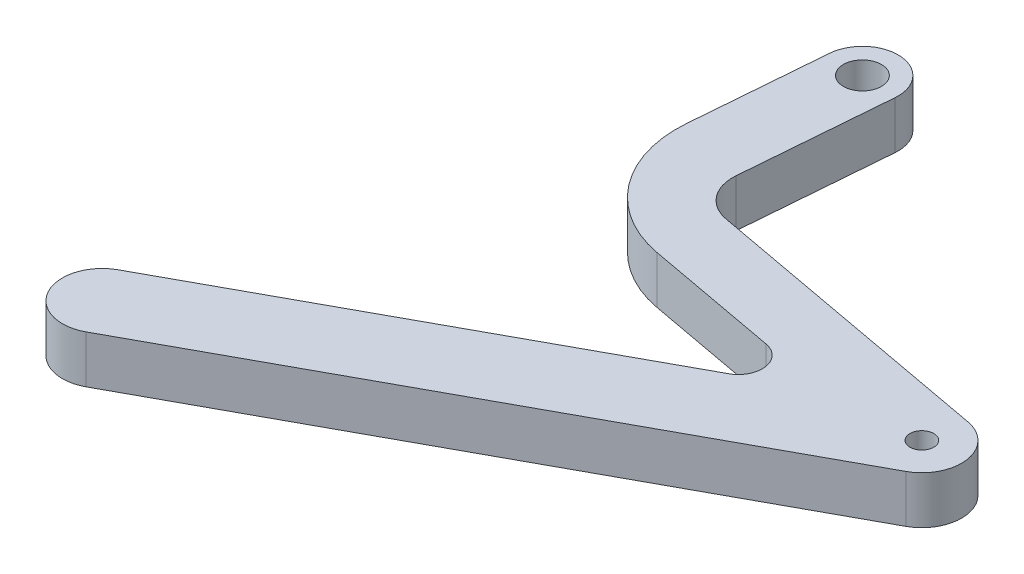
ISO-10303-21;
HEADER;
FILE_DESCRIPTION(('STEP AP214'),'2;1');
FILE_NAME('part.step','',(''),(''),'','','');
FILE_SCHEMA(('AUTOMOTIVE_DESIGN { 1 0 10303 214 1 1 1 1 }'));
ENDSEC;
DATA;
#1=APPLICATION_CONTEXT('core data for automotive mechanical design processes');
#2=APPLICATION_PROTOCOL_DEFINITION('international standard','automotive_design',2000,#1);
#3=PRODUCT_CONTEXT('',#1,'mechanical');
#4=PRODUCT('Part','Part','',(#3));
#5=PRODUCT_RELATED_PRODUCT_CATEGORY('part','',(#4));
#6=PRODUCT_DEFINITION_FORMATION('','',#4);
#7=PRODUCT_DEFINITION_CONTEXT('part definition',#1,'design');
#8=PRODUCT_DEFINITION('design','',#6,#7);
#9=PRODUCT_DEFINITION_SHAPE('','',#8);
#10=(LENGTH_UNIT() NAMED_UNIT(*) SI_UNIT(.MILLI.,.METRE.));
#11=(NAMED_UNIT(*) PLANE_ANGLE_UNIT() SI_UNIT($,.RADIAN.));
#12=(NAMED_UNIT(*) SI_UNIT($,.STERADIAN.) SOLID_ANGLE_UNIT());
#13=UNCERTAINTY_MEASURE_WITH_UNIT(LENGTH_MEASURE(1.E-05),#10,'distance_accuracy_value','');
#14=(GEOMETRIC_REPRESENTATION_CONTEXT(3) GLOBAL_UNCERTAINTY_ASSIGNED_CONTEXT((#13)) GLOBAL_UNIT_ASSIGNED_CONTEXT((#10,
#11,#12)) REPRESENTATION_CONTEXT('',''));
#15=CARTESIAN_POINT('',(0.,0.,0.));
#16=DIRECTION('',(0.,0.,1.));
#17=DIRECTION('',(1.,0.,0.));
#18=AXIS2_PLACEMENT_3D('',#15,#16,#17);
#19=CARTESIAN_POINT('',(-14.9507769922202,6.,-35.5583894921375));
#20=DIRECTION('',(0.,1.,0.));
#21=DIRECTION('',(0.,0.,1.));
#22=AXIS2_PLACEMENT_3D('',#19,#20,#21);
#23=PLANE('',#22);
#24=CARTESIAN_POINT('',(28.6208766536185,6.,0.518070957400363));
#25=DIRECTION('',(0.,1.,0.));
#26=DIRECTION('',(0.,0.,1.));
#27=AXIS2_PLACEMENT_3D('',#24,#25,#26);
#28=CIRCLE('',#27,1.5);
#29=CARTESIAN_POINT('',(28.6208766536185,6.,2.01807095740036));
#30=VERTEX_POINT('',#29);
#31=EDGE_CURVE('E176',#30,#30,#28,.T.);
#32=ORIENTED_EDGE('',*,*,#31,.F.);
#33=EDGE_LOOP('',(#32));
#34=FACE_BOUND('',#33,.T.);
#35=CARTESIAN_POINT('',(-14.9507769922202,6.,-35.5583894921375));
#36=DIRECTION('',(0.,1.,0.));
#37=DIRECTION('',(0.,0.,1.));
#38=AXIS2_PLACEMENT_3D('',#35,#36,#37);
#39=CIRCLE('',#38,4.5);
#40=CARTESIAN_POINT('',(-10.4654241033231,6.,-35.1956093079184));
#41=VERTEX_POINT('',#40);
#42=CARTESIAN_POINT('',(-19.4361298811174,6.,-35.9211696763566));
#43=VERTEX_POINT('',#42);
#44=EDGE_CURVE('E206',#41,#43,#39,.T.);
#45=ORIENTED_EDGE('',*,*,#44,.T.);
#46=DIRECTION('',(-0.0806178187153559,0.,0.996745086421588));
#47=VECTOR('',#46,1.);
#48=CARTESIAN_POINT('',(-19.4361298811174,6.,-35.9211696763566));
#49=LINE('',#48,#47);
#50=CARTESIAN_POINT('',(-20.7844728986205,6.,-19.2504844739661));
#51=VERTEX_POINT('',#50);
#52=EDGE_CURVE('E118',#43,#51,#49,.T.);
#53=ORIENTED_EDGE('',*,*,#52,.T.);
#54=CARTESIAN_POINT('',(-5.8332966022967,6.,-18.0412171932358));
#55=DIRECTION('',(0.,1.,0.));
#56=DIRECTION('',(0.,0.,1.));
#57=AXIS2_PLACEMENT_3D('',#54,#55,#56);
#58=CIRCLE('',#57,15.);
#59=CARTESIAN_POINT('',(-8.55484757689384,6.,-3.29017789789567));
#60=VERTEX_POINT('',#59);
#61=EDGE_CURVE('E243',#51,#60,#58,.T.);
#62=ORIENTED_EDGE('',*,*,#61,.T.);
#63=DIRECTION('',(0.983402619689343,0.,0.181436731639811));
#64=VECTOR('',#63,1.);
#65=CARTESIAN_POINT('',(-8.55484757689384,6.,-3.29017789789567));
#66=LINE('',#65,#64);
#67=CARTESIAN_POINT('',(8.30381974861666,6.,-0.179771805719755));
#68=VERTEX_POINT('',#67);
#69=EDGE_CURVE('E263',#60,#68,#66,.T.);
#70=ORIENTED_EDGE('',*,*,#69,.T.);
#71=CARTESIAN_POINT('',(7.75950955369726,6.,2.77043605334827));
#72=DIRECTION('',(0.,-1.,0.));
#73=DIRECTION('',(0.,0.,1.));
#74=AXIS2_PLACEMENT_3D('',#71,#72,#73);
#75=CIRCLE('',#74,2.99999999999999);
#76=CARTESIAN_POINT('',(9.19441325918511,6.,5.40502356489107));
#77=VERTEX_POINT('',#76);
#78=EDGE_CURVE('E259',#68,#77,#75,.T.);
#79=ORIENTED_EDGE('',*,*,#78,.T.);
#80=DIRECTION('',(-0.878195837180931,0.,0.478301235162616));
#81=VECTOR('',#80,1.);
#82=CARTESIAN_POINT('',(9.19441325918511,6.,5.40502356489107));
#83=LINE('',#82,#81);
#84=CARTESIAN_POINT('',(-40.6520319070363,6.,32.5534286040251));
#85=VERTEX_POINT('',#84);
#86=EDGE_CURVE('E262',#77,#85,#83,.T.);
#87=ORIENTED_EDGE('',*,*,#86,.T.);
#88=CARTESIAN_POINT('',(-38.2605257312233,6.,36.9444077899298));
#89=DIRECTION('',(0.,1.,0.));
#90=DIRECTION('',(0.,0.,1.));
#91=AXIS2_PLACEMENT_3D('',#88,#89,#90);
#92=CIRCLE('',#91,5.00000000000001);
#93=CARTESIAN_POINT('',(-35.8690195554101,6.,41.3353869758344));
#94=VERTEX_POINT('',#93);
#95=EDGE_CURVE('E267',#85,#94,#92,.T.);
#96=ORIENTED_EDGE('',*,*,#95,.T.);
#97=DIRECTION('',(0.878195837180931,0.,-0.478301235162616));
#98=VECTOR('',#97,1.);
#99=CARTESIAN_POINT('',(-35.8690195554101,6.,41.3353869758344));
#100=LINE('',#99,#98);
#101=CARTESIAN_POINT('',(31.0123828294316,6.,4.909050143305));
#102=VERTEX_POINT('',#101);
#103=EDGE_CURVE('E274',#94,#102,#100,.T.);
#104=ORIENTED_EDGE('',*,*,#103,.T.);
#105=CARTESIAN_POINT('',(28.6208766536185,6.,0.518070957400363));
#106=DIRECTION('',(0.,1.,0.));
#107=DIRECTION('',(0.,0.,1.));
#108=AXIS2_PLACEMENT_3D('',#105,#106,#107);
#109=CIRCLE('',#108,5.);
#110=CARTESIAN_POINT('',(29.5280603118175,6.,-4.39894214104634));
#111=VERTEX_POINT('',#110);
#112=EDGE_CURVE('E149',#102,#111,#109,.T.);
#113=ORIENTED_EDGE('',*,*,#112,.T.);
#114=DIRECTION('',(-0.983402619689344,0.,-0.18143673163981));
#115=VECTOR('',#114,1.);
#116=CARTESIAN_POINT('',(29.5280603118175,6.,-4.39894214104634));
#117=LINE('',#116,#115);
#118=CARTESIAN_POINT('',(-7.89106848235816,6.,-11.302731385953));
#119=VERTEX_POINT('',#118);
#120=EDGE_CURVE('E143',#111,#119,#117,.T.);
#121=ORIENTED_EDGE('',*,*,#120,.T.);
#122=CARTESIAN_POINT('',(-6.98388482415911,6.,-16.2197444843997));
#123=DIRECTION('',(0.,-1.,0.));
#124=DIRECTION('',(0.,0.,1.));
#125=AXIS2_PLACEMENT_3D('',#122,#123,#124);
#126=CIRCLE('',#125,5.);
#127=CARTESIAN_POINT('',(-11.9676102562671,6.,-16.6228335779765));
#128=VERTEX_POINT('',#127);
#129=EDGE_CURVE('E147',#119,#128,#126,.T.);
#130=ORIENTED_EDGE('',*,*,#129,.T.);
#131=DIRECTION('',(0.0806178187153569,0.,-0.996745086421587));
#132=VECTOR('',#131,1.);
#133=CARTESIAN_POINT('',(-11.9676102562671,6.,-16.6228335779765));
#134=LINE('',#133,#132);
#135=EDGE_CURVE('E63',#128,#41,#134,.T.);
#136=ORIENTED_EDGE('',*,*,#135,.T.);
#137=EDGE_LOOP('',(#45,#53,#62,#70,#79,#87,#96,#104,#113,#121,#130,#136));
#138=FACE_BOUND('',#137,.T.);
#139=CARTESIAN_POINT('',(-14.9507769922202,6.,-35.5583894921375));
#140=DIRECTION('',(0.,1.,0.));
#141=DIRECTION('',(0.,0.,1.));
#142=AXIS2_PLACEMENT_3D('',#139,#140,#141);
#143=CIRCLE('',#142,2.4);
#144=CARTESIAN_POINT('',(-14.9507769922202,6.,-33.1583894921375));
#145=VERTEX_POINT('',#144);
#146=EDGE_CURVE('E318',#145,#145,#143,.T.);
#147=ORIENTED_EDGE('',*,*,#146,.F.);
#148=EDGE_LOOP('',(#147));
#149=FACE_BOUND('',#148,.T.);
#150=ADVANCED_FACE('F45',(#34,#138,#149),#23,.T.);
#151=CARTESIAN_POINT('',(-14.9507769922202,0.,-35.5583894921375));
#152=DIRECTION('',(0.,1.,0.));
#153=DIRECTION('',(0.,0.,1.));
#154=AXIS2_PLACEMENT_3D('',#151,#152,#153);
#155=PLANE('',#154);
#156=CARTESIAN_POINT('',(-14.9507769922202,0.,-35.5583894921375));
#157=DIRECTION('',(0.,1.,0.));
#158=DIRECTION('',(0.,0.,1.));
#159=AXIS2_PLACEMENT_3D('',#156,#157,#158);
#160=CIRCLE('',#159,4.5);
#161=CARTESIAN_POINT('',(-10.4654241033231,0.,-35.1956093079184));
#162=VERTEX_POINT('',#161);
#163=CARTESIAN_POINT('',(-19.4361298811174,0.,-35.9211696763566));
#164=VERTEX_POINT('',#163);
#165=EDGE_CURVE('E171',#162,#164,#160,.T.);
#166=ORIENTED_EDGE('',*,*,#165,.F.);
#167=DIRECTION('',(0.0806178187153569,0.,-0.996745086421587));
#168=VECTOR('',#167,1.);
#169=CARTESIAN_POINT('',(-11.9676102562671,0.,-16.6228335779765));
#170=LINE('',#169,#168);
#171=CARTESIAN_POINT('',(-11.9676102562671,0.,-16.6228335779765));
#172=VERTEX_POINT('',#171);
#173=EDGE_CURVE('E110',#172,#162,#170,.T.);
#174=ORIENTED_EDGE('',*,*,#173,.F.);
#175=CARTESIAN_POINT('',(-6.98388482415911,0.,-16.2197444843997));
#176=DIRECTION('',(0.,-1.,0.));
#177=DIRECTION('',(0.,0.,1.));
#178=AXIS2_PLACEMENT_3D('',#175,#176,#177);
#179=CIRCLE('',#178,5.);
#180=CARTESIAN_POINT('',(-7.89106848235816,0.,-11.302731385953));
#181=VERTEX_POINT('',#180);
#182=EDGE_CURVE('E104',#181,#172,#179,.T.);
#183=ORIENTED_EDGE('',*,*,#182,.F.);
#184=DIRECTION('',(-0.983402619689344,0.,-0.18143673163981));
#185=VECTOR('',#184,1.);
#186=CARTESIAN_POINT('',(29.5280603118175,0.,-4.39894214104634));
#187=LINE('',#186,#185);
#188=CARTESIAN_POINT('',(29.5280603118175,0.,-4.39894214104634));
#189=VERTEX_POINT('',#188);
#190=EDGE_CURVE('E158',#189,#181,#187,.T.);
#191=ORIENTED_EDGE('',*,*,#190,.F.);
#192=CARTESIAN_POINT('',(28.6208766536185,0.,0.518070957400363));
#193=DIRECTION('',(0.,1.,0.));
#194=DIRECTION('',(0.,0.,1.));
#195=AXIS2_PLACEMENT_3D('',#192,#193,#194);
#196=CIRCLE('',#195,5.);
#197=CARTESIAN_POINT('',(31.0123828294316,0.,4.909050143305));
#198=VERTEX_POINT('',#197);
#199=EDGE_CURVE('E197',#198,#189,#196,.T.);
#200=ORIENTED_EDGE('',*,*,#199,.F.);
#201=DIRECTION('',(0.878195837180931,0.,-0.478301235162616));
#202=VECTOR('',#201,1.);
#203=CARTESIAN_POINT('',(-35.8690195554101,0.,41.3353869758344));
#204=LINE('',#203,#202);
#205=CARTESIAN_POINT('',(-35.8690195554101,0.,41.3353869758344));
#206=VERTEX_POINT('',#205);
#207=EDGE_CURVE('E194',#206,#198,#204,.T.);
#208=ORIENTED_EDGE('',*,*,#207,.F.);
#209=CARTESIAN_POINT('',(-38.2605257312233,0.,36.9444077899298));
#210=DIRECTION('',(0.,1.,0.));
#211=DIRECTION('',(0.,0.,1.));
#212=AXIS2_PLACEMENT_3D('',#209,#210,#211);
#213=CIRCLE('',#212,5.00000000000001);
#214=CARTESIAN_POINT('',(-40.6520319070363,0.,32.5534286040251));
#215=VERTEX_POINT('',#214);
#216=EDGE_CURVE('E191',#215,#206,#213,.T.);
#217=ORIENTED_EDGE('',*,*,#216,.F.);
#218=DIRECTION('',(-0.878195837180931,0.,0.478301235162616));
#219=VECTOR('',#218,1.);
#220=CARTESIAN_POINT('',(9.19441325918511,0.,5.40502356489107));
#221=LINE('',#220,#219);
#222=CARTESIAN_POINT('',(9.19441325918511,0.,5.40502356489107));
#223=VERTEX_POINT('',#222);
#224=EDGE_CURVE('E188',#223,#215,#221,.T.);
#225=ORIENTED_EDGE('',*,*,#224,.F.);
#226=CARTESIAN_POINT('',(7.75950955369726,0.,2.77043605334827));
#227=DIRECTION('',(0.,-1.,0.));
#228=DIRECTION('',(0.,0.,1.));
#229=AXIS2_PLACEMENT_3D('',#226,#227,#228);
#230=CIRCLE('',#229,2.99999999999999);
#231=CARTESIAN_POINT('',(8.30381974861666,0.,-0.179771805719755));
#232=VERTEX_POINT('',#231);
#233=EDGE_CURVE('E185',#232,#223,#230,.T.);
#234=ORIENTED_EDGE('',*,*,#233,.F.);
#235=DIRECTION('',(0.983402619689343,0.,0.181436731639811));
#236=VECTOR('',#235,1.);
#237=CARTESIAN_POINT('',(-8.55484757689384,0.,-3.29017789789567));
#238=LINE('',#237,#236);
#239=CARTESIAN_POINT('',(-8.55484757689384,0.,-3.29017789789567));
#240=VERTEX_POINT('',#239);
#241=EDGE_CURVE('E182',#240,#232,#238,.T.);
#242=ORIENTED_EDGE('',*,*,#241,.F.);
#243=CARTESIAN_POINT('',(-5.8332966022967,0.,-18.0412171932358));
#244=DIRECTION('',(0.,1.,0.));
#245=DIRECTION('',(0.,0.,1.));
#246=AXIS2_PLACEMENT_3D('',#243,#244,#245);
#247=CIRCLE('',#246,15.);
#248=CARTESIAN_POINT('',(-20.7844728986205,0.,-19.2504844739661));
#249=VERTEX_POINT('',#248);
#250=EDGE_CURVE('E179',#249,#240,#247,.T.);
#251=ORIENTED_EDGE('',*,*,#250,.F.);
#252=DIRECTION('',(-0.0806178187153559,0.,0.996745086421588));
#253=VECTOR('',#252,1.);
#254=CARTESIAN_POINT('',(-19.4361298811174,0.,-35.9211696763566));
#255=LINE('',#254,#253);
#256=EDGE_CURVE('E175',#164,#249,#255,.T.);
#257=ORIENTED_EDGE('',*,*,#256,.F.);
#258=EDGE_LOOP('',(#166,#174,#183,#191,#200,#208,#217,#225,#234,#242,#251,#257));
#259=FACE_BOUND('',#258,.T.);
#260=CARTESIAN_POINT('',(28.6208766536185,0.,0.518070957400363));
#261=DIRECTION('',(0.,1.,0.));
#262=DIRECTION('',(0.,0.,1.));
#263=AXIS2_PLACEMENT_3D('',#260,#261,#262);
#264=CIRCLE('',#263,1.5);
#265=CARTESIAN_POINT('',(28.6208766536185,0.,2.01807095740036));
#266=VERTEX_POINT('',#265);
#267=EDGE_CURVE('E326',#266,#266,#264,.T.);
#268=ORIENTED_EDGE('',*,*,#267,.T.);
#269=EDGE_LOOP('',(#268));
#270=FACE_BOUND('',#269,.T.);
#271=CARTESIAN_POINT('',(-14.9507769922202,0.,-35.5583894921375));
#272=DIRECTION('',(0.,1.,0.));
#273=DIRECTION('',(0.,0.,1.));
#274=AXIS2_PLACEMENT_3D('',#271,#272,#273);
#275=CIRCLE('',#274,2.4);
#276=CARTESIAN_POINT('',(-14.9507769922202,0.,-33.1583894921375));
#277=VERTEX_POINT('',#276);
#278=EDGE_CURVE('E321',#277,#277,#275,.T.);
#279=ORIENTED_EDGE('',*,*,#278,.T.);
#280=EDGE_LOOP('',(#279));
#281=FACE_BOUND('',#280,.T.);
#282=ADVANCED_FACE('F247',(#259,#270,#281),#155,.F.);
#283=CARTESIAN_POINT('',(-14.9507769922202,6.,-35.5583894921375));
#284=DIRECTION('',(0.,-1.,0.));
#285=DIRECTION('',(0.,0.,-1.));
#286=AXIS2_PLACEMENT_3D('',#283,#284,#285);
#287=CYLINDRICAL_SURFACE('',#286,4.5);
#288=ORIENTED_EDGE('',*,*,#165,.T.);
#289=DIRECTION('',(0.,-1.,0.));
#290=VECTOR('',#289,1.);
#291=CARTESIAN_POINT('',(-19.4361298811174,6.,-35.9211696763566));
#292=LINE('',#291,#290);
#293=EDGE_CURVE('E11',#43,#164,#292,.T.);
#294=ORIENTED_EDGE('',*,*,#293,.F.);
#295=ORIENTED_EDGE('',*,*,#44,.F.);
#296=DIRECTION('',(0.,-1.,0.));
#297=VECTOR('',#296,1.);
#298=CARTESIAN_POINT('',(-10.4654241033231,6.,-35.1956093079184));
#299=LINE('',#298,#297);
#300=EDGE_CURVE('E167',#41,#162,#299,.T.);
#301=ORIENTED_EDGE('',*,*,#300,.T.);
#302=EDGE_LOOP('',(#288,#294,#295,#301));
#303=FACE_BOUND('',#302,.T.);
#304=ADVANCED_FACE('F47',(#303),#287,.T.);
#305=CARTESIAN_POINT('',(-19.4361298811174,6.,-35.9211696763566));
#306=DIRECTION('',(0.996745086421587,0.,0.0806178187153559));
#307=DIRECTION('',(0.0806178187153559,0.,-0.996745086421588));
#308=AXIS2_PLACEMENT_3D('',#305,#306,#307);
#309=PLANE('',#308);
#310=ORIENTED_EDGE('',*,*,#256,.T.);
#311=DIRECTION('',(0.,-1.,0.));
#312=VECTOR('',#311,1.);
#313=CARTESIAN_POINT('',(-20.7844728986205,6.,-19.2504844739661));
#314=LINE('',#313,#312);
#315=EDGE_CURVE('E55',#51,#249,#314,.T.);
#316=ORIENTED_EDGE('',*,*,#315,.F.);
#317=ORIENTED_EDGE('',*,*,#52,.F.);
#318=ORIENTED_EDGE('',*,*,#293,.T.);
#319=EDGE_LOOP('',(#310,#316,#317,#318));
#320=FACE_BOUND('',#319,.T.);
#321=ADVANCED_FACE('F426',(#320),#309,.F.);
#322=CARTESIAN_POINT('',(-5.8332966022967,6.,-18.0412171932358));
#323=DIRECTION('',(0.,-1.,0.));
#324=DIRECTION('',(0.,0.,-1.));
#325=AXIS2_PLACEMENT_3D('',#322,#323,#324);
#326=CYLINDRICAL_SURFACE('',#325,15.);
#327=ORIENTED_EDGE('',*,*,#250,.T.);
#328=DIRECTION('',(0.,-1.,0.));
#329=VECTOR('',#328,1.);
#330=CARTESIAN_POINT('',(-8.55484757689384,6.,-3.29017789789567));
#331=LINE('',#330,#329);
#332=EDGE_CURVE('E233',#60,#240,#331,.T.);
#333=ORIENTED_EDGE('',*,*,#332,.F.);
#334=ORIENTED_EDGE('',*,*,#61,.F.);
#335=ORIENTED_EDGE('',*,*,#315,.T.);
#336=EDGE_LOOP('',(#327,#333,#334,#335));
#337=FACE_BOUND('',#336,.T.);
#338=ADVANCED_FACE('F241',(#337),#326,.T.);
#339=CARTESIAN_POINT('',(-8.55484757689384,6.,-3.29017789789567));
#340=DIRECTION('',(0.181436731639811,0.,-0.983402619689343));
#341=DIRECTION('',(-0.983402619689343,0.,-0.181436731639811));
#342=AXIS2_PLACEMENT_3D('',#339,#340,#341);
#343=PLANE('',#342);
#344=ORIENTED_EDGE('',*,*,#241,.T.);
#345=DIRECTION('',(0.,-1.,0.));
#346=VECTOR('',#345,1.);
#347=CARTESIAN_POINT('',(8.30381974861666,6.,-0.179771805719755));
#348=LINE('',#347,#346);
#349=EDGE_CURVE('E229',#68,#232,#348,.T.);
#350=ORIENTED_EDGE('',*,*,#349,.F.);
#351=ORIENTED_EDGE('',*,*,#69,.F.);
#352=ORIENTED_EDGE('',*,*,#332,.T.);
#353=EDGE_LOOP('',(#344,#350,#351,#352));
#354=FACE_BOUND('',#353,.T.);
#355=ADVANCED_FACE('F253',(#354),#343,.F.);
#356=CARTESIAN_POINT('',(7.75950955369726,6.,2.77043605334827));
#357=DIRECTION('',(0.,-1.,0.));
#358=DIRECTION('',(0.,0.,-1.));
#359=AXIS2_PLACEMENT_3D('',#356,#357,#358);
#360=CYLINDRICAL_SURFACE('',#359,2.99999999999999);
#361=ORIENTED_EDGE('',*,*,#233,.T.);
#362=DIRECTION('',(0.,-1.,0.));
#363=VECTOR('',#362,1.);
#364=CARTESIAN_POINT('',(9.19441325918511,6.,5.40502356489107));
#365=LINE('',#364,#363);
#366=EDGE_CURVE('E225',#77,#223,#365,.T.);
#367=ORIENTED_EDGE('',*,*,#366,.F.);
#368=ORIENTED_EDGE('',*,*,#78,.F.);
#369=ORIENTED_EDGE('',*,*,#349,.T.);
#370=EDGE_LOOP('',(#361,#367,#368,#369));
#371=FACE_BOUND('',#370,.T.);
#372=ADVANCED_FACE('F257',(#371),#360,.F.);
#373=CARTESIAN_POINT('',(9.19441325918511,6.,5.40502356489107));
#374=DIRECTION('',(0.478301235162616,0.,0.878195837180931));
#375=DIRECTION('',(0.878195837180931,0.,-0.478301235162616));
#376=AXIS2_PLACEMENT_3D('',#373,#374,#375);
#377=PLANE('',#376);
#378=ORIENTED_EDGE('',*,*,#224,.T.);
#379=DIRECTION('',(0.,-1.,0.));
#380=VECTOR('',#379,1.);
#381=CARTESIAN_POINT('',(-40.6520319070363,6.,32.5534286040251));
#382=LINE('',#381,#380);
#383=EDGE_CURVE('E221',#85,#215,#382,.T.);
#384=ORIENTED_EDGE('',*,*,#383,.F.);
#385=ORIENTED_EDGE('',*,*,#86,.F.);
#386=ORIENTED_EDGE('',*,*,#366,.T.);
#387=EDGE_LOOP('',(#378,#384,#385,#386));
#388=FACE_BOUND('',#387,.T.);
#389=ADVANCED_FACE('F391',(#388),#377,.F.);
#390=CARTESIAN_POINT('',(-38.2605257312233,6.,36.9444077899298));
#391=DIRECTION('',(0.,-1.,0.));
#392=DIRECTION('',(0.,0.,-1.));
#393=AXIS2_PLACEMENT_3D('',#390,#391,#392);
#394=CYLINDRICAL_SURFACE('',#393,5.00000000000001);
#395=ORIENTED_EDGE('',*,*,#216,.T.);
#396=DIRECTION('',(0.,-1.,0.));
#397=VECTOR('',#396,1.);
#398=CARTESIAN_POINT('',(-35.8690195554101,6.,41.3353869758344));
#399=LINE('',#398,#397);
#400=EDGE_CURVE('E217',#94,#206,#399,.T.);
#401=ORIENTED_EDGE('',*,*,#400,.F.);
#402=ORIENTED_EDGE('',*,*,#95,.F.);
#403=ORIENTED_EDGE('',*,*,#383,.T.);
#404=EDGE_LOOP('',(#395,#401,#402,#403));
#405=FACE_BOUND('',#404,.T.);
#406=ADVANCED_FACE('F382',(#405),#394,.T.);
#407=CARTESIAN_POINT('',(-35.8690195554101,6.,41.3353869758344));
#408=DIRECTION('',(-0.478301235162616,0.,-0.878195837180931));
#409=DIRECTION('',(-0.878195837180931,0.,0.478301235162616));
#410=AXIS2_PLACEMENT_3D('',#407,#408,#409);
#411=PLANE('',#410);
#412=ORIENTED_EDGE('',*,*,#207,.T.);
#413=DIRECTION('',(0.,-1.,0.));
#414=VECTOR('',#413,1.);
#415=CARTESIAN_POINT('',(31.0123828294316,6.,4.909050143305));
#416=LINE('',#415,#414);
#417=EDGE_CURVE('E213',#102,#198,#416,.T.);
#418=ORIENTED_EDGE('',*,*,#417,.F.);
#419=ORIENTED_EDGE('',*,*,#103,.F.);
#420=ORIENTED_EDGE('',*,*,#400,.T.);
#421=EDGE_LOOP('',(#412,#418,#419,#420));
#422=FACE_BOUND('',#421,.T.);
#423=ADVANCED_FACE('F282',(#422),#411,.F.);
#424=CARTESIAN_POINT('',(28.6208766536185,6.,0.518070957400363));
#425=DIRECTION('',(0.,-1.,0.));
#426=DIRECTION('',(0.,0.,-1.));
#427=AXIS2_PLACEMENT_3D('',#424,#425,#426);
#428=CYLINDRICAL_SURFACE('',#427,5.);
#429=ORIENTED_EDGE('',*,*,#199,.T.);
#430=DIRECTION('',(0.,-1.,0.));
#431=VECTOR('',#430,1.);
#432=CARTESIAN_POINT('',(29.5280603118175,6.,-4.39894214104634));
#433=LINE('',#432,#431);
#434=EDGE_CURVE('E160',#111,#189,#433,.T.);
#435=ORIENTED_EDGE('',*,*,#434,.F.);
#436=ORIENTED_EDGE('',*,*,#112,.F.);
#437=ORIENTED_EDGE('',*,*,#417,.T.);
#438=EDGE_LOOP('',(#429,#435,#436,#437));
#439=FACE_BOUND('',#438,.T.);
#440=ADVANCED_FACE('F286',(#439),#428,.T.);
#441=CARTESIAN_POINT('',(29.5280603118175,6.,-4.39894214104634));
#442=DIRECTION('',(-0.18143673163981,0.,0.983402619689344));
#443=DIRECTION('',(0.983402619689344,0.,0.18143673163981));
#444=AXIS2_PLACEMENT_3D('',#441,#442,#443);
#445=PLANE('',#444);
#446=ORIENTED_EDGE('',*,*,#190,.T.);
#447=DIRECTION('',(0.,-1.,0.));
#448=VECTOR('',#447,1.);
#449=CARTESIAN_POINT('',(-7.89106848235816,6.,-11.302731385953));
#450=LINE('',#449,#448);
#451=EDGE_CURVE('E155',#119,#181,#450,.T.);
#452=ORIENTED_EDGE('',*,*,#451,.F.);
#453=ORIENTED_EDGE('',*,*,#120,.F.);
#454=ORIENTED_EDGE('',*,*,#434,.T.);
#455=EDGE_LOOP('',(#446,#452,#453,#454));
#456=FACE_BOUND('',#455,.T.);
#457=ADVANCED_FACE('F156',(#456),#445,.F.);
#458=CARTESIAN_POINT('',(-6.98388482415911,6.,-16.2197444843997));
#459=DIRECTION('',(0.,-1.,0.));
#460=DIRECTION('',(0.,0.,-1.));
#461=AXIS2_PLACEMENT_3D('',#458,#459,#460);
#462=CYLINDRICAL_SURFACE('',#461,5.);
#463=ORIENTED_EDGE('',*,*,#182,.T.);
#464=DIRECTION('',(0.,-1.,0.));
#465=VECTOR('',#464,1.);
#466=CARTESIAN_POINT('',(-11.9676102562671,6.,-16.6228335779765));
#467=LINE('',#466,#465);
#468=EDGE_CURVE('E161',#128,#172,#467,.T.);
#469=ORIENTED_EDGE('',*,*,#468,.F.);
#470=ORIENTED_EDGE('',*,*,#129,.F.);
#471=ORIENTED_EDGE('',*,*,#451,.T.);
#472=EDGE_LOOP('',(#463,#469,#470,#471));
#473=FACE_BOUND('',#472,.T.);
#474=ADVANCED_FACE('F163',(#473),#462,.F.);
#475=CARTESIAN_POINT('',(-11.9676102562671,6.,-16.6228335779765));
#476=DIRECTION('',(-0.996745086421588,0.,-0.0806178187153569));
#477=DIRECTION('',(-0.0806178187153569,0.,0.996745086421588));
#478=AXIS2_PLACEMENT_3D('',#475,#476,#477);
#479=PLANE('',#478);
#480=ORIENTED_EDGE('',*,*,#173,.T.);
#481=ORIENTED_EDGE('',*,*,#300,.F.);
#482=ORIENTED_EDGE('',*,*,#135,.F.);
#483=ORIENTED_EDGE('',*,*,#468,.T.);
#484=EDGE_LOOP('',(#480,#481,#482,#483));
#485=FACE_BOUND('',#484,.T.);
#486=ADVANCED_FACE('F290',(#485),#479,.F.);
#487=CARTESIAN_POINT('',(28.6208766536185,6.,0.518070957400363));
#488=DIRECTION('',(0.,-1.,0.));
#489=DIRECTION('',(0.,0.,-1.));
#490=AXIS2_PLACEMENT_3D('',#487,#488,#489);
#491=CYLINDRICAL_SURFACE('',#490,1.5);
#492=ORIENTED_EDGE('',*,*,#31,.T.);
#493=EDGE_LOOP('',(#492));
#494=FACE_BOUND('',#493,.T.);
#495=ORIENTED_EDGE('',*,*,#267,.F.);
#496=EDGE_LOOP('',(#495));
#497=FACE_BOUND('',#496,.T.);
#498=ADVANCED_FACE('F292',(#494,#497),#491,.F.);
#499=CARTESIAN_POINT('',(-14.9507769922202,6.,-35.5583894921375));
#500=DIRECTION('',(0.,-1.,0.));
#501=DIRECTION('',(0.,0.,-1.));
#502=AXIS2_PLACEMENT_3D('',#499,#500,#501);
#503=CYLINDRICAL_SURFACE('',#502,2.4);
#504=ORIENTED_EDGE('',*,*,#146,.T.);
#505=EDGE_LOOP('',(#504));
#506=FACE_BOUND('',#505,.T.);
#507=ORIENTED_EDGE('',*,*,#278,.F.);
#508=EDGE_LOOP('',(#507));
#509=FACE_BOUND('',#508,.T.);
#510=ADVANCED_FACE('F298',(#506,#509),#503,.F.);
#511=CLOSED_SHELL('',(#150,#282,#304,#321,#338,#355,#372,#389,#406,#423,#440,#457,#474,#486,
#498,#510));
#512=MANIFOLD_SOLID_BREP('B2',#511);
#513=ADVANCED_BREP_SHAPE_REPRESENTATION('',(#18,#512),#14);
#514=SHAPE_DEFINITION_REPRESENTATION(#9,#513);
ENDSEC;
END-ISO-10303-21;
